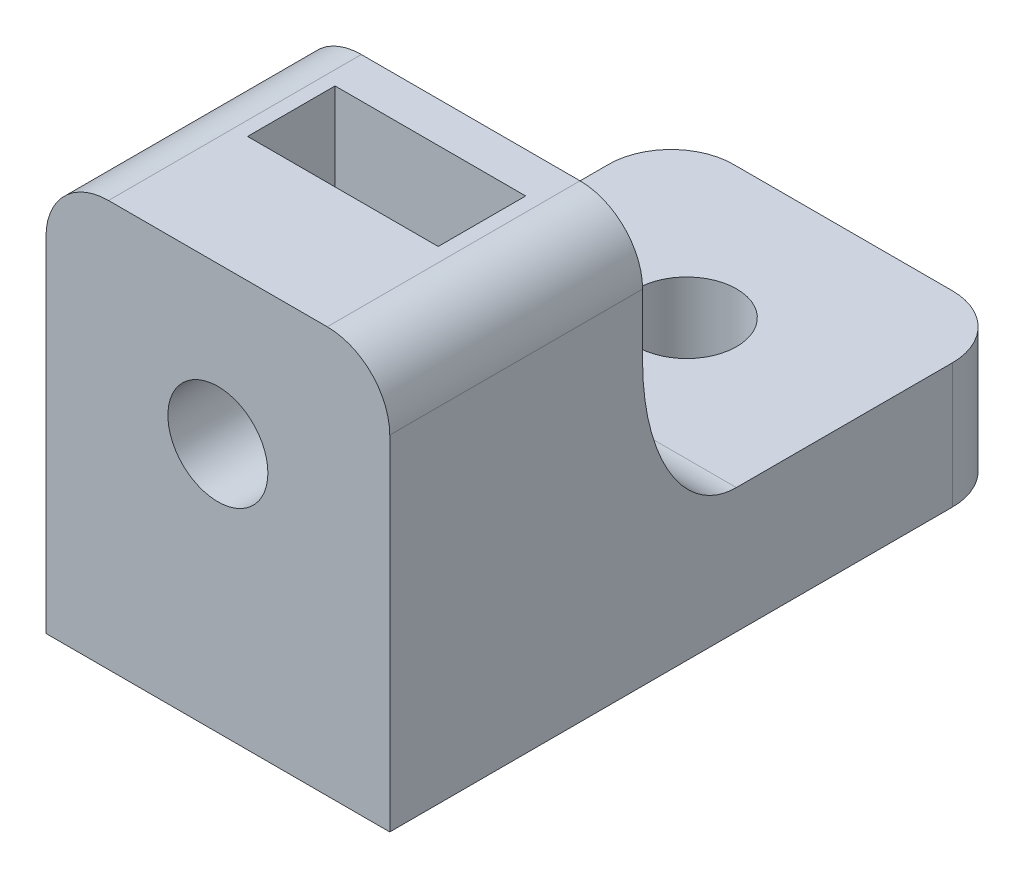
ISO-10303-21;
HEADER;
FILE_DESCRIPTION(('STEP AP214'),'2;1');
FILE_NAME('part.step','',(''),(''),'','','');
FILE_SCHEMA(('AUTOMOTIVE_DESIGN { 1 0 10303 214 1 1 1 1 }'));
ENDSEC;
DATA;
#1=APPLICATION_CONTEXT('core data for automotive mechanical design processes');
#2=APPLICATION_PROTOCOL_DEFINITION('international standard','automotive_design',2000,#1);
#3=PRODUCT_CONTEXT('',#1,'mechanical');
#4=PRODUCT('Part','Part','',(#3));
#5=PRODUCT_RELATED_PRODUCT_CATEGORY('part','',(#4));
#6=PRODUCT_DEFINITION_FORMATION('','',#4);
#7=PRODUCT_DEFINITION_CONTEXT('part definition',#1,'design');
#8=PRODUCT_DEFINITION('design','',#6,#7);
#9=PRODUCT_DEFINITION_SHAPE('','',#8);
#10=(LENGTH_UNIT() NAMED_UNIT(*) SI_UNIT(.MILLI.,.METRE.));
#11=(NAMED_UNIT(*) PLANE_ANGLE_UNIT() SI_UNIT($,.RADIAN.));
#12=(NAMED_UNIT(*) SI_UNIT($,.STERADIAN.) SOLID_ANGLE_UNIT());
#13=UNCERTAINTY_MEASURE_WITH_UNIT(LENGTH_MEASURE(1.E-05),#10,'distance_accuracy_value','');
#14=(GEOMETRIC_REPRESENTATION_CONTEXT(3) GLOBAL_UNCERTAINTY_ASSIGNED_CONTEXT((#13)) GLOBAL_UNIT_ASSIGNED_CONTEXT((#10,
#11,#12)) REPRESENTATION_CONTEXT('',''));
#15=CARTESIAN_POINT('',(0.,0.,0.));
#16=DIRECTION('',(0.,0.,1.));
#17=DIRECTION('',(1.,0.,0.));
#18=AXIS2_PLACEMENT_3D('',#15,#16,#17);
#19=CARTESIAN_POINT('',(0.,4.,0.));
#20=DIRECTION('',(0.,-1.,0.));
#21=DIRECTION('',(0.,0.,-1.));
#22=AXIS2_PLACEMENT_3D('',#19,#20,#21);
#23=PLANE('',#22);
#24=CARTESIAN_POINT('',(0.,4.,-15.));
#25=DIRECTION('',(0.,-1.,0.));
#26=DIRECTION('',(0.,0.,-1.));
#27=AXIS2_PLACEMENT_3D('',#24,#25,#26);
#28=CIRCLE('',#27,1.59999999999999);
#29=CARTESIAN_POINT('',(0.,4.,-16.6));
#30=VERTEX_POINT('',#29);
#31=EDGE_CURVE('E637',#30,#30,#28,.T.);
#32=ORIENTED_EDGE('',*,*,#31,.T.);
#33=EDGE_LOOP('',(#32));
#34=FACE_BOUND('',#33,.T.);
#35=DIRECTION('',(0.,0.,-1.));
#36=VECTOR('',#35,1.);
#37=CARTESIAN_POINT('',(5.5,4.,0.));
#38=LINE('',#37,#36);
#39=CARTESIAN_POINT('',(5.5,4.,-11.0899523705258));
#40=VERTEX_POINT('',#39);
#41=CARTESIAN_POINT('',(5.5,4.,-18.));
#42=VERTEX_POINT('',#41);
#43=EDGE_CURVE('E212',#40,#42,#38,.T.);
#44=ORIENTED_EDGE('',*,*,#43,.T.);
#45=CARTESIAN_POINT('',(3.5,4.,-18.));
#46=DIRECTION('',(0.,-1.,0.));
#47=DIRECTION('',(0.,0.,-1.));
#48=AXIS2_PLACEMENT_3D('',#45,#46,#47);
#49=CIRCLE('',#48,2.);
#50=CARTESIAN_POINT('',(3.5,4.,-20.));
#51=VERTEX_POINT('',#50);
#52=EDGE_CURVE('E13',#42,#51,#49,.F.);
#53=ORIENTED_EDGE('',*,*,#52,.T.);
#54=DIRECTION('',(1.,0.,0.));
#55=VECTOR('',#54,1.);
#56=CARTESIAN_POINT('',(-5.5,4.,-20.));
#57=LINE('',#56,#55);
#58=CARTESIAN_POINT('',(-3.5,4.,-20.));
#59=VERTEX_POINT('',#58);
#60=EDGE_CURVE('E204',#59,#51,#57,.T.);
#61=ORIENTED_EDGE('',*,*,#60,.F.);
#62=CARTESIAN_POINT('',(-3.5,4.,-18.));
#63=DIRECTION('',(0.,-1.,0.));
#64=DIRECTION('',(0.,0.,-1.));
#65=AXIS2_PLACEMENT_3D('',#62,#63,#64);
#66=CIRCLE('',#65,2.);
#67=CARTESIAN_POINT('',(-5.5,4.,-18.));
#68=VERTEX_POINT('',#67);
#69=EDGE_CURVE('E63',#59,#68,#66,.F.);
#70=ORIENTED_EDGE('',*,*,#69,.T.);
#71=DIRECTION('',(0.,0.,-1.));
#72=VECTOR('',#71,1.);
#73=CARTESIAN_POINT('',(-5.5,4.,0.));
#74=LINE('',#73,#72);
#75=CARTESIAN_POINT('',(-5.5,4.,-11.0899523705258));
#76=VERTEX_POINT('',#75);
#77=EDGE_CURVE('E207',#76,#68,#74,.T.);
#78=ORIENTED_EDGE('',*,*,#77,.F.);
#79=CARTESIAN_POINT('',(6.05,4.,-11.0899523705258));
#80=CARTESIAN_POINT('',(2.01666666666666,4.,-11.0899523705258));
#81=CARTESIAN_POINT('',(-2.01666666666666,4.,-11.0899523705258));
#82=CARTESIAN_POINT('',(-6.05,4.,-11.0899523705258));
#83=(BOUNDED_CURVE() B_SPLINE_CURVE(3,(#79,#80,#81,#82),.UNSPECIFIED.,.F.,
.F.) B_SPLINE_CURVE_WITH_KNOTS((4,4),(-0.00605,0.00605),
.UNSPECIFIED.) CURVE() GEOMETRIC_REPRESENTATION_ITEM() RATIONAL_B_SPLINE_CURVE((1.,1.,1.,1.)) REPRESENTATION_ITEM(''));
#84=EDGE_CURVE('E217',#76,#40,#83,.F.);
#85=ORIENTED_EDGE('',*,*,#84,.T.);
#86=EDGE_LOOP('',(#44,#53,#61,#70,#78,#85));
#87=FACE_BOUND('',#86,.T.);
#88=ADVANCED_FACE('F55',(#34,#87),#23,.F.);
#89=CARTESIAN_POINT('',(-5.5,4.,0.));
#90=DIRECTION('',(-1.,0.,0.));
#91=DIRECTION('',(0.,0.,1.));
#92=AXIS2_PLACEMENT_3D('',#89,#90,#91);
#93=PLANE('',#92);
#94=DIRECTION('',(0.,-1.,0.));
#95=VECTOR('',#94,1.);
#96=CARTESIAN_POINT('',(-5.5,4.,0.));
#97=LINE('',#96,#95);
#98=CARTESIAN_POINT('',(-5.5,11.,0.));
#99=VERTEX_POINT('',#98);
#100=CARTESIAN_POINT('',(-5.5,0.,0.));
#101=VERTEX_POINT('',#100);
#102=EDGE_CURVE('E601',#99,#101,#97,.T.);
#103=ORIENTED_EDGE('',*,*,#102,.F.);
#104=DIRECTION('',(0.,0.,-1.));
#105=VECTOR('',#104,1.);
#106=CARTESIAN_POINT('',(-5.5,11.,0.));
#107=LINE('',#106,#105);
#108=CARTESIAN_POINT('',(-5.5,11.,-8.08995237052581));
#109=VERTEX_POINT('',#108);
#110=EDGE_CURVE('E563',#99,#109,#107,.T.);
#111=ORIENTED_EDGE('',*,*,#110,.T.);
#112=DIRECTION('',(0.,-1.,0.));
#113=VECTOR('',#112,1.);
#114=CARTESIAN_POINT('',(-5.5,13.,-8.08995237052581));
#115=LINE('',#114,#113);
#116=CARTESIAN_POINT('',(-5.5,9.00000000000001,-8.08995237052581));
#117=VERTEX_POINT('',#116);
#118=EDGE_CURVE('E193',#109,#117,#115,.T.);
#119=ORIENTED_EDGE('',*,*,#118,.T.);
#120=CARTESIAN_POINT('',(-5.5,4.,-11.0899523705258));
#121=CARTESIAN_POINT('',(-5.5,4.,-8.08995237052581));
#122=CARTESIAN_POINT('',(-5.5,9.,-8.08995237052581));
#123=(BOUNDED_CURVE() B_SPLINE_CURVE(2,(#120,#121,#122),.UNSPECIFIED.,.F.,
.F.) B_SPLINE_CURVE_WITH_KNOTS((3,3),(0.,1.),
.UNSPECIFIED.) CURVE() GEOMETRIC_REPRESENTATION_ITEM() RATIONAL_B_SPLINE_CURVE((1.,
0.707106781186548,1.)) REPRESENTATION_ITEM(''));
#124=EDGE_CURVE('E267',#117,#76,#123,.F.);
#125=ORIENTED_EDGE('',*,*,#124,.T.);
#126=ORIENTED_EDGE('',*,*,#77,.T.);
#127=DIRECTION('',(0.,-1.,0.));
#128=VECTOR('',#127,1.);
#129=CARTESIAN_POINT('',(-5.5,4.,-18.));
#130=LINE('',#129,#128);
#131=CARTESIAN_POINT('',(-5.5,0.,-18.));
#132=VERTEX_POINT('',#131);
#133=EDGE_CURVE('E551',#68,#132,#130,.T.);
#134=ORIENTED_EDGE('',*,*,#133,.T.);
#135=DIRECTION('',(0.,0.,-1.));
#136=VECTOR('',#135,1.);
#137=CARTESIAN_POINT('',(-5.5,0.,0.));
#138=LINE('',#137,#136);
#139=EDGE_CURVE('E562',#101,#132,#138,.T.);
#140=ORIENTED_EDGE('',*,*,#139,.F.);
#141=EDGE_LOOP('',(#103,#111,#119,#125,#126,#134,#140));
#142=FACE_BOUND('',#141,.T.);
#143=ADVANCED_FACE('F233',(#142),#93,.T.);
#144=CARTESIAN_POINT('',(-5.5,4.,0.));
#145=DIRECTION('',(0.,0.,-1.));
#146=DIRECTION('',(-1.,0.,0.));
#147=AXIS2_PLACEMENT_3D('',#144,#145,#146);
#148=PLANE('',#147);
#149=CARTESIAN_POINT('',(0.,8.,0.));
#150=DIRECTION('',(0.,0.,1.));
#151=DIRECTION('',(1.,0.,0.));
#152=AXIS2_PLACEMENT_3D('',#149,#150,#151);
#153=CIRCLE('',#152,1.59999999999999);
#154=CARTESIAN_POINT('',(1.59999999999999,8.,0.));
#155=VERTEX_POINT('',#154);
#156=EDGE_CURVE('E653',#155,#155,#153,.T.);
#157=ORIENTED_EDGE('',*,*,#156,.F.);
#158=EDGE_LOOP('',(#157));
#159=FACE_BOUND('',#158,.T.);
#160=DIRECTION('',(1.,0.,0.));
#161=VECTOR('',#160,1.);
#162=CARTESIAN_POINT('',(0.,13.,0.));
#163=LINE('',#162,#161);
#164=CARTESIAN_POINT('',(-3.5,13.,0.));
#165=VERTEX_POINT('',#164);
#166=CARTESIAN_POINT('',(3.5,13.,0.));
#167=VERTEX_POINT('',#166);
#168=EDGE_CURVE('E628',#165,#167,#163,.T.);
#169=ORIENTED_EDGE('',*,*,#168,.F.);
#170=CARTESIAN_POINT('',(-3.5,11.,0.));
#171=DIRECTION('',(0.,0.,-1.));
#172=DIRECTION('',(-1.,0.,0.));
#173=AXIS2_PLACEMENT_3D('',#170,#171,#172);
#174=CIRCLE('',#173,2.);
#175=EDGE_CURVE('E575',#165,#99,#174,.F.);
#176=ORIENTED_EDGE('',*,*,#175,.T.);
#177=ORIENTED_EDGE('',*,*,#102,.T.);
#178=DIRECTION('',(1.,0.,0.));
#179=VECTOR('',#178,1.);
#180=CARTESIAN_POINT('',(-5.5,0.,0.));
#181=LINE('',#180,#179);
#182=CARTESIAN_POINT('',(5.5,0.,0.));
#183=VERTEX_POINT('',#182);
#184=EDGE_CURVE('E211',#101,#183,#181,.T.);
#185=ORIENTED_EDGE('',*,*,#184,.T.);
#186=DIRECTION('',(0.,-1.,0.));
#187=VECTOR('',#186,1.);
#188=CARTESIAN_POINT('',(5.5,4.,0.));
#189=LINE('',#188,#187);
#190=CARTESIAN_POINT('',(5.5,11.,0.));
#191=VERTEX_POINT('',#190);
#192=EDGE_CURVE('E602',#191,#183,#189,.T.);
#193=ORIENTED_EDGE('',*,*,#192,.F.);
#194=CARTESIAN_POINT('',(3.5,11.,0.));
#195=DIRECTION('',(0.,0.,-1.));
#196=DIRECTION('',(-1.,0.,0.));
#197=AXIS2_PLACEMENT_3D('',#194,#195,#196);
#198=CIRCLE('',#197,2.);
#199=EDGE_CURVE('E573',#191,#167,#198,.F.);
#200=ORIENTED_EDGE('',*,*,#199,.T.);
#201=EDGE_LOOP('',(#169,#176,#177,#185,#193,#200));
#202=FACE_BOUND('',#201,.T.);
#203=ADVANCED_FACE('F242',(#159,#202),#148,.F.);
#204=CARTESIAN_POINT('',(5.5,4.,0.));
#205=DIRECTION('',(-1.,0.,0.));
#206=DIRECTION('',(0.,0.,1.));
#207=AXIS2_PLACEMENT_3D('',#204,#205,#206);
#208=PLANE('',#207);
#209=DIRECTION('',(0.,-1.,0.));
#210=VECTOR('',#209,1.);
#211=CARTESIAN_POINT('',(5.5,13.,-8.08995237052581));
#212=LINE('',#211,#210);
#213=CARTESIAN_POINT('',(5.5,11.,-8.08995237052581));
#214=VERTEX_POINT('',#213);
#215=CARTESIAN_POINT('',(5.5,9.00000000000001,-8.08995237052581));
#216=VERTEX_POINT('',#215);
#217=EDGE_CURVE('E196',#214,#216,#212,.T.);
#218=ORIENTED_EDGE('',*,*,#217,.F.);
#219=DIRECTION('',(0.,0.,-1.));
#220=VECTOR('',#219,1.);
#221=CARTESIAN_POINT('',(5.5,11.,0.));
#222=LINE('',#221,#220);
#223=EDGE_CURVE('E579',#214,#191,#222,.F.);
#224=ORIENTED_EDGE('',*,*,#223,.T.);
#225=ORIENTED_EDGE('',*,*,#192,.T.);
#226=DIRECTION('',(0.,0.,-1.));
#227=VECTOR('',#226,1.);
#228=CARTESIAN_POINT('',(5.5,0.,0.));
#229=LINE('',#228,#227);
#230=CARTESIAN_POINT('',(5.5,0.,-18.));
#231=VERTEX_POINT('',#230);
#232=EDGE_CURVE('E609',#183,#231,#229,.T.);
#233=ORIENTED_EDGE('',*,*,#232,.T.);
#234=DIRECTION('',(0.,-1.,0.));
#235=VECTOR('',#234,1.);
#236=CARTESIAN_POINT('',(5.5,4.,-18.));
#237=LINE('',#236,#235);
#238=EDGE_CURVE('E577',#231,#42,#237,.F.);
#239=ORIENTED_EDGE('',*,*,#238,.T.);
#240=ORIENTED_EDGE('',*,*,#43,.F.);
#241=CARTESIAN_POINT('',(5.5,9.,-8.08995237052581));
#242=CARTESIAN_POINT('',(5.5,4.,-8.08995237052581));
#243=CARTESIAN_POINT('',(5.5,4.,-11.0899523705258));
#244=(BOUNDED_CURVE() B_SPLINE_CURVE(2,(#241,#242,#243),.UNSPECIFIED.,.F.,
.F.) B_SPLINE_CURVE_WITH_KNOTS((3,3),(0.,1.),
.UNSPECIFIED.) CURVE() GEOMETRIC_REPRESENTATION_ITEM() RATIONAL_B_SPLINE_CURVE((1.,
0.707106781186548,1.)) REPRESENTATION_ITEM(''));
#245=EDGE_CURVE('E597',#40,#216,#244,.F.);
#246=ORIENTED_EDGE('',*,*,#245,.T.);
#247=EDGE_LOOP('',(#218,#224,#225,#233,#239,#240,#246));
#248=FACE_BOUND('',#247,.T.);
#249=ADVANCED_FACE('F245',(#248),#208,.F.);
#250=CARTESIAN_POINT('',(-5.5,4.,-20.));
#251=DIRECTION('',(0.,0.,-1.));
#252=DIRECTION('',(-1.,0.,0.));
#253=AXIS2_PLACEMENT_3D('',#250,#251,#252);
#254=PLANE('',#253);
#255=ORIENTED_EDGE('',*,*,#60,.T.);
#256=DIRECTION('',(0.,-1.,0.));
#257=VECTOR('',#256,1.);
#258=CARTESIAN_POINT('',(3.5,0.,-20.));
#259=LINE('',#258,#257);
#260=CARTESIAN_POINT('',(3.5,0.,-20.));
#261=VERTEX_POINT('',#260);
#262=EDGE_CURVE('E582',#51,#261,#259,.T.);
#263=ORIENTED_EDGE('',*,*,#262,.T.);
#264=DIRECTION('',(1.,0.,0.));
#265=VECTOR('',#264,1.);
#266=CARTESIAN_POINT('',(-5.5,0.,-20.));
#267=LINE('',#266,#265);
#268=CARTESIAN_POINT('',(-3.5,0.,-20.));
#269=VERTEX_POINT('',#268);
#270=EDGE_CURVE('E612',#269,#261,#267,.T.);
#271=ORIENTED_EDGE('',*,*,#270,.F.);
#272=DIRECTION('',(0.,-1.,0.));
#273=VECTOR('',#272,1.);
#274=CARTESIAN_POINT('',(-3.5,4.,-20.));
#275=LINE('',#274,#273);
#276=EDGE_CURVE('E75',#269,#59,#275,.F.);
#277=ORIENTED_EDGE('',*,*,#276,.T.);
#278=EDGE_LOOP('',(#255,#263,#271,#277));
#279=FACE_BOUND('',#278,.T.);
#280=ADVANCED_FACE('F240',(#279),#254,.T.);
#281=CARTESIAN_POINT('',(0.,0.,0.));
#282=DIRECTION('',(0.,-1.,0.));
#283=DIRECTION('',(0.,0.,-1.));
#284=AXIS2_PLACEMENT_3D('',#281,#282,#283);
#285=PLANE('',#284);
#286=CARTESIAN_POINT('',(0.,0.,-15.));
#287=DIRECTION('',(0.,-1.,0.));
#288=DIRECTION('',(0.,0.,-1.));
#289=AXIS2_PLACEMENT_3D('',#286,#287,#288);
#290=CIRCLE('',#289,1.59999999999999);
#291=CARTESIAN_POINT('',(0.,0.,-16.6));
#292=VERTEX_POINT('',#291);
#293=EDGE_CURVE('E640',#292,#292,#290,.T.);
#294=ORIENTED_EDGE('',*,*,#293,.F.);
#295=EDGE_LOOP('',(#294));
#296=FACE_BOUND('',#295,.T.);
#297=ORIENTED_EDGE('',*,*,#270,.T.);
#298=CARTESIAN_POINT('',(3.5,0.,-18.));
#299=DIRECTION('',(0.,-1.,0.));
#300=DIRECTION('',(0.,0.,-1.));
#301=AXIS2_PLACEMENT_3D('',#298,#299,#300);
#302=CIRCLE('',#301,2.);
#303=EDGE_CURVE('E587',#261,#231,#302,.T.);
#304=ORIENTED_EDGE('',*,*,#303,.T.);
#305=ORIENTED_EDGE('',*,*,#232,.F.);
#306=ORIENTED_EDGE('',*,*,#184,.F.);
#307=ORIENTED_EDGE('',*,*,#139,.T.);
#308=CARTESIAN_POINT('',(-3.5,0.,-18.));
#309=DIRECTION('',(0.,-1.,0.));
#310=DIRECTION('',(0.,0.,-1.));
#311=AXIS2_PLACEMENT_3D('',#308,#309,#310);
#312=CIRCLE('',#311,2.);
#313=EDGE_CURVE('E585',#132,#269,#312,.T.);
#314=ORIENTED_EDGE('',*,*,#313,.T.);
#315=EDGE_LOOP('',(#297,#304,#305,#306,#307,#314));
#316=FACE_BOUND('',#315,.T.);
#317=ADVANCED_FACE('F236',(#296,#316),#285,.T.);
#318=CARTESIAN_POINT('',(0.,13.,-8.08995237052581));
#319=DIRECTION('',(0.,0.,1.));
#320=DIRECTION('',(1.,0.,0.));
#321=AXIS2_PLACEMENT_3D('',#318,#319,#320);
#322=PLANE('',#321);
#323=ORIENTED_EDGE('',*,*,#118,.F.);
#324=CARTESIAN_POINT('',(-3.5,11.,-8.08995237052581));
#325=DIRECTION('',(0.,0.,1.));
#326=DIRECTION('',(1.,0.,0.));
#327=AXIS2_PLACEMENT_3D('',#324,#325,#326);
#328=CIRCLE('',#327,2.);
#329=CARTESIAN_POINT('',(-3.5,13.,-8.08995237052581));
#330=VERTEX_POINT('',#329);
#331=EDGE_CURVE('E566',#109,#330,#328,.F.);
#332=ORIENTED_EDGE('',*,*,#331,.T.);
#333=DIRECTION('',(-1.,0.,0.));
#334=VECTOR('',#333,1.);
#335=CARTESIAN_POINT('',(0.,13.,-8.08995237052581));
#336=LINE('',#335,#334);
#337=CARTESIAN_POINT('',(3.5,13.,-8.08995237052581));
#338=VERTEX_POINT('',#337);
#339=EDGE_CURVE('E556',#338,#330,#336,.T.);
#340=ORIENTED_EDGE('',*,*,#339,.F.);
#341=CARTESIAN_POINT('',(3.5,11.,-8.08995237052581));
#342=DIRECTION('',(0.,0.,1.));
#343=DIRECTION('',(1.,0.,0.));
#344=AXIS2_PLACEMENT_3D('',#341,#342,#343);
#345=CIRCLE('',#344,2.);
#346=EDGE_CURVE('E564',#338,#214,#345,.F.);
#347=ORIENTED_EDGE('',*,*,#346,.T.);
#348=ORIENTED_EDGE('',*,*,#217,.T.);
#349=CARTESIAN_POINT('',(-6.05,9.,-8.08995237052581));
#350=CARTESIAN_POINT('',(-2.01666666666666,9.,-8.08995237052581));
#351=CARTESIAN_POINT('',(2.01666666666666,9.,-8.08995237052581));
#352=CARTESIAN_POINT('',(6.05,9.,-8.08995237052581));
#353=(BOUNDED_CURVE() B_SPLINE_CURVE(3,(#349,#350,#351,#352),.UNSPECIFIED.,.F.,
.F.) B_SPLINE_CURVE_WITH_KNOTS((4,4),(-0.00605,0.00605),
.UNSPECIFIED.) CURVE() GEOMETRIC_REPRESENTATION_ITEM() RATIONAL_B_SPLINE_CURVE((1.,1.,1.,1.)) REPRESENTATION_ITEM(''));
#354=CARTESIAN_POINT('',(1.24899959967967,9.,-8.08995237052581));
#355=VERTEX_POINT('',#354);
#356=EDGE_CURVE('E600',#216,#355,#353,.F.);
#357=ORIENTED_EDGE('',*,*,#356,.T.);
#358=CARTESIAN_POINT('',(0.,8.,-8.08995237052581));
#359=DIRECTION('',(0.,0.,1.));
#360=DIRECTION('',(1.,0.,0.));
#361=AXIS2_PLACEMENT_3D('',#358,#359,#360);
#362=CIRCLE('',#361,1.59999999999999);
#363=CARTESIAN_POINT('',(-1.24899959967967,9.,-8.08995237052581));
#364=VERTEX_POINT('',#363);
#365=EDGE_CURVE('E649',#355,#364,#362,.T.);
#366=ORIENTED_EDGE('',*,*,#365,.T.);
#367=CARTESIAN_POINT('',(-6.05,9.,-8.08995237052581));
#368=CARTESIAN_POINT('',(-2.01666666666666,9.,-8.08995237052581));
#369=CARTESIAN_POINT('',(2.01666666666666,9.,-8.08995237052581));
#370=CARTESIAN_POINT('',(6.05,9.,-8.08995237052581));
#371=(BOUNDED_CURVE() B_SPLINE_CURVE(3,(#367,#368,#369,#370),.UNSPECIFIED.,.F.,
.F.) B_SPLINE_CURVE_WITH_KNOTS((4,4),(-0.00605,0.00605),
.UNSPECIFIED.) CURVE() GEOMETRIC_REPRESENTATION_ITEM() RATIONAL_B_SPLINE_CURVE((1.,1.,1.,1.)) REPRESENTATION_ITEM(''));
#372=EDGE_CURVE('E382',#364,#117,#371,.F.);
#373=ORIENTED_EDGE('',*,*,#372,.T.);
#374=EDGE_LOOP('',(#323,#332,#340,#347,#348,#357,#366,#373));
#375=FACE_BOUND('',#374,.T.);
#376=ADVANCED_FACE('F239',(#375),#322,.F.);
#377=CARTESIAN_POINT('',(-3.05,13.,0.));
#378=DIRECTION('',(1.,0.,0.));
#379=DIRECTION('',(0.,0.,-1.));
#380=AXIS2_PLACEMENT_3D('',#377,#378,#379);
#381=PLANE('',#380);
#382=DIRECTION('',(0.,0.,1.));
#383=VECTOR('',#382,1.);
#384=CARTESIAN_POINT('',(-3.05,4.8,0.));
#385=LINE('',#384,#383);
#386=CARTESIAN_POINT('',(-3.05,4.8,-6.8));
#387=VERTEX_POINT('',#386);
#388=CARTESIAN_POINT('',(-3.05,4.8,-4.));
#389=VERTEX_POINT('',#388);
#390=EDGE_CURVE('E170',#387,#389,#385,.T.);
#391=ORIENTED_EDGE('',*,*,#390,.F.);
#392=DIRECTION('',(0.,-1.,0.));
#393=VECTOR('',#392,1.);
#394=CARTESIAN_POINT('',(-3.05,13.,-6.8));
#395=LINE('',#394,#393);
#396=CARTESIAN_POINT('',(-3.05,13.,-6.8));
#397=VERTEX_POINT('',#396);
#398=EDGE_CURVE('E182',#397,#387,#395,.T.);
#399=ORIENTED_EDGE('',*,*,#398,.F.);
#400=DIRECTION('',(0.,0.,1.));
#401=VECTOR('',#400,1.);
#402=CARTESIAN_POINT('',(-3.05,13.,0.));
#403=LINE('',#402,#401);
#404=CARTESIAN_POINT('',(-3.05,13.,-4.));
#405=VERTEX_POINT('',#404);
#406=EDGE_CURVE('E635',#397,#405,#403,.T.);
#407=ORIENTED_EDGE('',*,*,#406,.T.);
#408=DIRECTION('',(0.,-1.,0.));
#409=VECTOR('',#408,1.);
#410=CARTESIAN_POINT('',(-3.05,13.,-4.));
#411=LINE('',#410,#409);
#412=EDGE_CURVE('E185',#405,#389,#411,.T.);
#413=ORIENTED_EDGE('',*,*,#412,.T.);
#414=EDGE_LOOP('',(#391,#399,#407,#413));
#415=FACE_BOUND('',#414,.T.);
#416=ADVANCED_FACE('F180',(#415),#381,.T.);
#417=CARTESIAN_POINT('',(0.,13.,-6.8));
#418=DIRECTION('',(0.,0.,1.));
#419=DIRECTION('',(1.,0.,0.));
#420=AXIS2_PLACEMENT_3D('',#417,#418,#419);
#421=PLANE('',#420);
#422=DIRECTION('',(-1.,0.,0.));
#423=VECTOR('',#422,1.);
#424=CARTESIAN_POINT('',(0.,4.8,-6.8));
#425=LINE('',#424,#423);
#426=CARTESIAN_POINT('',(3.05,4.8,-6.8));
#427=VERTEX_POINT('',#426);
#428=EDGE_CURVE('E167',#427,#387,#425,.T.);
#429=ORIENTED_EDGE('',*,*,#428,.F.);
#430=DIRECTION('',(0.,-1.,0.));
#431=VECTOR('',#430,1.);
#432=CARTESIAN_POINT('',(3.05,13.,-6.8));
#433=LINE('',#432,#431);
#434=CARTESIAN_POINT('',(3.05,13.,-6.8));
#435=VERTEX_POINT('',#434);
#436=EDGE_CURVE('E194',#435,#427,#433,.T.);
#437=ORIENTED_EDGE('',*,*,#436,.F.);
#438=DIRECTION('',(-1.,0.,0.));
#439=VECTOR('',#438,1.);
#440=CARTESIAN_POINT('',(0.,13.,-6.8));
#441=LINE('',#440,#439);
#442=EDGE_CURVE('E192',#435,#397,#441,.T.);
#443=ORIENTED_EDGE('',*,*,#442,.T.);
#444=ORIENTED_EDGE('',*,*,#398,.T.);
#445=EDGE_LOOP('',(#429,#437,#443,#444));
#446=FACE_BOUND('',#445,.T.);
#447=CARTESIAN_POINT('',(0.,8.,-6.8));
#448=DIRECTION('',(0.,0.,1.));
#449=DIRECTION('',(1.,0.,0.));
#450=AXIS2_PLACEMENT_3D('',#447,#448,#449);
#451=CIRCLE('',#450,1.59999999999999);
#452=CARTESIAN_POINT('',(1.59999999999999,8.,-6.8));
#453=VERTEX_POINT('',#452);
#454=EDGE_CURVE('E643',#453,#453,#451,.T.);
#455=ORIENTED_EDGE('',*,*,#454,.F.);
#456=EDGE_LOOP('',(#455));
#457=FACE_BOUND('',#456,.T.);
#458=ADVANCED_FACE('F189',(#446,#457),#421,.T.);
#459=CARTESIAN_POINT('',(3.05,13.,0.));
#460=DIRECTION('',(1.,0.,0.));
#461=DIRECTION('',(0.,0.,-1.));
#462=AXIS2_PLACEMENT_3D('',#459,#460,#461);
#463=PLANE('',#462);
#464=ORIENTED_EDGE('',*,*,#436,.T.);
#465=DIRECTION('',(0.,0.,1.));
#466=VECTOR('',#465,1.);
#467=CARTESIAN_POINT('',(3.05,4.8,0.));
#468=LINE('',#467,#466);
#469=CARTESIAN_POINT('',(3.05,4.8,-4.));
#470=VERTEX_POINT('',#469);
#471=EDGE_CURVE('E173',#427,#470,#468,.T.);
#472=ORIENTED_EDGE('',*,*,#471,.T.);
#473=DIRECTION('',(0.,-1.,0.));
#474=VECTOR('',#473,1.);
#475=CARTESIAN_POINT('',(3.05,13.,-4.));
#476=LINE('',#475,#474);
#477=CARTESIAN_POINT('',(3.05,13.,-4.));
#478=VERTEX_POINT('',#477);
#479=EDGE_CURVE('E198',#478,#470,#476,.T.);
#480=ORIENTED_EDGE('',*,*,#479,.F.);
#481=DIRECTION('',(0.,0.,1.));
#482=VECTOR('',#481,1.);
#483=CARTESIAN_POINT('',(3.05,13.,0.));
#484=LINE('',#483,#482);
#485=EDGE_CURVE('E630',#435,#478,#484,.T.);
#486=ORIENTED_EDGE('',*,*,#485,.F.);
#487=EDGE_LOOP('',(#464,#472,#480,#486));
#488=FACE_BOUND('',#487,.T.);
#489=ADVANCED_FACE('F404',(#488),#463,.F.);
#490=CARTESIAN_POINT('',(0.,13.,-4.));
#491=DIRECTION('',(0.,0.,1.));
#492=DIRECTION('',(1.,0.,0.));
#493=AXIS2_PLACEMENT_3D('',#490,#491,#492);
#494=PLANE('',#493);
#495=CARTESIAN_POINT('',(0.,8.,-4.));
#496=DIRECTION('',(0.,0.,1.));
#497=DIRECTION('',(1.,0.,0.));
#498=AXIS2_PLACEMENT_3D('',#495,#496,#497);
#499=CIRCLE('',#498,1.59999999999999);
#500=CARTESIAN_POINT('',(1.59999999999999,8.,-4.));
#501=VERTEX_POINT('',#500);
#502=EDGE_CURVE('E646',#501,#501,#499,.T.);
#503=ORIENTED_EDGE('',*,*,#502,.T.);
#504=EDGE_LOOP('',(#503));
#505=FACE_BOUND('',#504,.T.);
#506=ORIENTED_EDGE('',*,*,#479,.T.);
#507=DIRECTION('',(-1.,0.,0.));
#508=VECTOR('',#507,1.);
#509=CARTESIAN_POINT('',(0.,4.8,-4.));
#510=LINE('',#509,#508);
#511=EDGE_CURVE('E186',#470,#389,#510,.T.);
#512=ORIENTED_EDGE('',*,*,#511,.T.);
#513=ORIENTED_EDGE('',*,*,#412,.F.);
#514=DIRECTION('',(-1.,0.,0.));
#515=VECTOR('',#514,1.);
#516=CARTESIAN_POINT('',(0.,13.,-4.));
#517=LINE('',#516,#515);
#518=EDGE_CURVE('E629',#478,#405,#517,.T.);
#519=ORIENTED_EDGE('',*,*,#518,.F.);
#520=EDGE_LOOP('',(#506,#512,#513,#519));
#521=FACE_BOUND('',#520,.T.);
#522=ADVANCED_FACE('F401',(#505,#521),#494,.F.);
#523=CARTESIAN_POINT('',(0.,13.,0.));
#524=DIRECTION('',(0.,1.,0.));
#525=DIRECTION('',(0.,0.,1.));
#526=AXIS2_PLACEMENT_3D('',#523,#524,#525);
#527=PLANE('',#526);
#528=ORIENTED_EDGE('',*,*,#406,.F.);
#529=ORIENTED_EDGE('',*,*,#442,.F.);
#530=ORIENTED_EDGE('',*,*,#485,.T.);
#531=ORIENTED_EDGE('',*,*,#518,.T.);
#532=EDGE_LOOP('',(#528,#529,#530,#531));
#533=FACE_BOUND('',#532,.T.);
#534=ORIENTED_EDGE('',*,*,#339,.T.);
#535=DIRECTION('',(0.,0.,-1.));
#536=VECTOR('',#535,1.);
#537=CARTESIAN_POINT('',(-3.5,13.,0.));
#538=LINE('',#537,#536);
#539=EDGE_CURVE('E571',#330,#165,#538,.F.);
#540=ORIENTED_EDGE('',*,*,#539,.T.);
#541=ORIENTED_EDGE('',*,*,#168,.T.);
#542=DIRECTION('',(0.,0.,-1.));
#543=VECTOR('',#542,1.);
#544=CARTESIAN_POINT('',(3.5,13.,-8.08995237052581));
#545=LINE('',#544,#543);
#546=EDGE_CURVE('E568',#167,#338,#545,.T.);
#547=ORIENTED_EDGE('',*,*,#546,.T.);
#548=EDGE_LOOP('',(#534,#540,#541,#547));
#549=FACE_BOUND('',#548,.T.);
#550=ADVANCED_FACE('F289',(#533,#549),#527,.T.);
#551=CARTESIAN_POINT('',(-6.05,4.,-11.0899523705258));
#552=CARTESIAN_POINT('',(-2.01666666666666,4.,-11.0899523705258));
#553=CARTESIAN_POINT('',(2.01666666666666,4.,-11.0899523705258));
#554=CARTESIAN_POINT('',(6.05,4.,-11.0899523705258));
#555=CARTESIAN_POINT('',(-6.05,4.,-8.08995237052581));
#556=CARTESIAN_POINT('',(-2.01666666666666,4.,-8.08995237052581));
#557=CARTESIAN_POINT('',(2.01666666666666,4.,-8.08995237052581));
#558=CARTESIAN_POINT('',(6.05,4.,-8.08995237052581));
#559=CARTESIAN_POINT('',(-6.05,9.,-8.08995237052581));
#560=CARTESIAN_POINT('',(-2.01666666666666,9.,-8.08995237052581));
#561=CARTESIAN_POINT('',(2.01666666666666,9.,-8.08995237052581));
#562=CARTESIAN_POINT('',(6.05,9.,-8.08995237052581));
#563=(BOUNDED_SURFACE() B_SPLINE_SURFACE(2,3,((#551,#552,#553,#554),(#555,#556,#557,#558),(#559,
#560,#561,#562)),.UNSPECIFIED.,.F.,.F.,.F.) B_SPLINE_SURFACE_WITH_KNOTS((3,3),(4,4),(0.,1.),
(-0.00605,0.00605),
.UNSPECIFIED.) GEOMETRIC_REPRESENTATION_ITEM() RATIONAL_B_SPLINE_SURFACE(((1.,1.,1.,1.),
(0.707106781186548,0.707106781186548,0.707106781186548,0.707106781186548),(1.,1.,1.,1.))) REPRESENTATION_ITEM('') SURFACE());
#564=CARTESIAN_POINT('',(-1.24899959967967,9.,-8.08995237052581));
#565=CARTESIAN_POINT('',(-1.27678745435603,8.96529392214953,-8.08995185790162));
#566=CARTESIAN_POINT('',(-1.30311519559637,8.92944309660353,-8.09016943443913));
#567=CARTESIAN_POINT('',(-1.35269414639994,8.85568343640425,-8.09112058469751));
#568=CARTESIAN_POINT('',(-1.37594553293495,8.81777472031119,-8.09185412872126));
#569=CARTESIAN_POINT('',(-1.44078211553794,8.70143401652357,-8.09494496893268));
#570=CARTESIAN_POINT('',(-1.4775447341588,8.62026854448331,-8.09819193504342));
#571=CARTESIAN_POINT('',(-1.53708393495765,8.45305060225022,-8.10753047452717));
#572=CARTESIAN_POINT('',(-1.55985095908922,8.36699483603603,-8.11362398691199));
#573=CARTESIAN_POINT('',(-1.58307744398425,8.23628488873141,-8.12503597626146));
#574=CARTESIAN_POINT('',(-1.58899897121057,8.19243987328803,-8.12921906730405));
#575=CARTESIAN_POINT('',(-1.59719883447628,8.10444991136329,-8.13834353085014));
#576=CARTESIAN_POINT('',(-1.59947400621649,8.06030473772592,-8.14328555788622));
#577=CARTESIAN_POINT('',(-1.60080507346764,7.92807745658,-8.15921037819308));
#578=CARTESIAN_POINT('',(-1.59439915573903,7.84001784226452,-8.17130798612193));
#579=CARTESIAN_POINT('',(-1.56732517576211,7.66652572210334,-8.19810942570079));
#580=CARTESIAN_POINT('',(-1.54665426088752,7.58109374528641,-8.21281377819439));
#581=CARTESIAN_POINT('',(-1.50527393873932,7.45580988685844,-8.2364832675125));
#582=CARTESIAN_POINT('',(-1.48953784751521,7.41411976233665,-8.24473379171677));
#583=CARTESIAN_POINT('',(-1.45470100435284,7.33230232438847,-8.26162504968136));
#584=CARTESIAN_POINT('',(-1.43560352610307,7.29217353637355,-8.27026539775436));
#585=CARTESIAN_POINT('',(-1.37342250301528,7.17442113503033,-8.29661523632765));
#586=CARTESIAN_POINT('',(-1.32544356656735,7.09941100545134,-8.31475745345594));
#587=CARTESIAN_POINT('',(-1.21624573420533,6.95641250192023,-8.35155935652578));
#588=CARTESIAN_POINT('',(-1.1546928475845,6.88868048955303,-8.37021926603706));
#589=CARTESIAN_POINT('',(-1.0207207561937,6.76449705200673,-8.40618212757983));
#590=CARTESIAN_POINT('',(-0.948300302102102,6.70804692552081,-8.42348492325059));
#591=CARTESIAN_POINT('',(-0.794439579127565,6.60813905202878,-8.45526154522642));
#592=CARTESIAN_POINT('',(-0.713001467287789,6.56467820711986,-8.46973604578541));
#593=CARTESIAN_POINT('',(-0.543320282836552,6.49225270308517,-8.49444396465543));
#594=CARTESIAN_POINT('',(-0.455080015078053,6.46328210545255,-8.50467912007204));
#595=CARTESIAN_POINT('',(-0.278693668235909,6.42197957932137,-8.51943247783806));
#596=CARTESIAN_POINT('',(-0.190735138588552,6.40893465256647,-8.52419505109156));
#597=CARTESIAN_POINT('',(-0.0137571796177215,6.39760595441588,-8.52832511001243));
#598=CARTESIAN_POINT('',(0.075261937398664,6.39931793989314,-8.52769414651019));
#599=CARTESIAN_POINT('',(0.247761143133976,6.41702531576241,-8.52125616059238));
#600=CARTESIAN_POINT('',(0.331314446994428,6.432400871917,-8.51567377508439));
#601=CARTESIAN_POINT('',(0.494568679524117,6.47601101487964,-8.50019543411705));
#602=CARTESIAN_POINT('',(0.574269210945333,6.50424692456604,-8.49029903490182));
#603=CARTESIAN_POINT('',(0.729155964999907,6.57323960134497,-8.46688706236474));
#604=CARTESIAN_POINT('',(0.804239751212586,6.61420529825975,-8.45331162074747));
#605=CARTESIAN_POINT('',(0.946625403668783,6.70727436175487,-8.42375227101167));
#606=CARTESIAN_POINT('',(1.01392524032111,6.75938062308888,-8.40776773723609));
#607=CARTESIAN_POINT('',(1.14265603643419,6.87647517524752,-8.37366202043299));
#608=CARTESIAN_POINT('',(1.2035757813996,6.94200607435998,-8.3554721305882));
#609=CARTESIAN_POINT('',(1.31367105586754,7.08227421850149,-8.31900664953575));
#610=CARTESIAN_POINT('',(1.36284445423125,7.15701313041695,-8.30073104338894));
#611=CARTESIAN_POINT('',(1.44936936798221,7.31607505938627,-8.26473486820372));
#612=CARTESIAN_POINT('',(1.4863447986028,7.40061023254454,-8.24704487696053));
#613=CARTESIAN_POINT('',(1.54531252955814,7.57515647119754,-8.21381757804712));
#614=CARTESIAN_POINT('',(1.56730642609504,7.66516695221407,-8.19828004118499));
#615=CARTESIAN_POINT('',(1.59523353302095,7.8466290244447,-8.17032678406154));
#616=CARTESIAN_POINT('',(1.60141594929474,7.93803511404936,-8.15786545740154));
#617=CARTESIAN_POINT('',(1.59804026823353,8.12095566573545,-8.13614988997909));
#618=CARTESIAN_POINT('',(1.58848213858241,8.212470128039,-8.12689565580101));
#619=CARTESIAN_POINT('',(1.55424374080266,8.39025707226458,-8.11186876082617));
#620=CARTESIAN_POINT('',(1.5299888567934,8.47660452949392,-8.10600691916228));
#621=CARTESIAN_POINT('',(1.46734064424124,8.64411662180398,-8.09713676413209));
#622=CARTESIAN_POINT('',(1.42896240551326,8.72528668036526,-8.09412541743358));
#623=CARTESIAN_POINT('',(1.36408512634294,8.8371829802171,-8.09147086495662));
#624=CARTESIAN_POINT('',(1.34275680825129,8.87097760365925,-8.0908859698978));
#625=CARTESIAN_POINT('',(1.29767391461833,8.9368181853319,-8.09012714682948));
#626=CARTESIAN_POINT('',(1.27392404084519,8.96886735364409,-8.08995243766783));
#627=CARTESIAN_POINT('',(1.2489995996797,9.,-8.08995237052581));
#628=B_SPLINE_CURVE_WITH_KNOTS('',3,(#564,#565,#566,#567,#568,#569,#570,#571,#572,#573,#574,
#575,#576,#577,#578,#579,#580,#581,#582,#583,#584,#585,#586,#587,#588,#589,#590,#591,#592,#593,
#594,#595,#596,#597,#598,#599,#600,#601,#602,#603,#604,#605,#606,#607,#608,#609,#610,#611,#612,
#613,#614,#615,#616,#617,#618,#619,#620,#621,#622,#623,#624,#625,#626,#627),.UNSPECIFIED.,.F.,
.F.,(4,2,2,2,2,2,2,2,2,2,2,2,2,2,2,2,2,2,2,2,2,2,2,2,2,2,2,2,2,2,2,4),(0.,0.133302221917791,
0.266596772094271,0.532735079472842,0.799054940017712,0.932238631250277,1.06553783653509,
1.3315756601617,1.59766669981595,1.73348634766429,1.86917444401257,2.14048562686085,
2.41941634391241,2.69837915108078,2.97727537330776,3.25605720225004,3.52183684337653,
3.7875400661346,4.04177234484948,4.29603078103814,4.55470484417814,4.81344620280405,
5.08612113624272,5.35884550356459,5.63932796738252,5.91978054262119,6.19578485271095,
6.47178972945206,6.74016396043179,7.00825228092091,7.12805699606679,7.24763337110921),.UNSPECIFIED.);
#629=EDGE_CURVE('E548',#364,#355,#628,.T.);
#630=ORIENTED_EDGE('',*,*,#372,.F.);
#631=ORIENTED_EDGE('',*,*,#629,.T.);
#632=ORIENTED_EDGE('',*,*,#356,.F.);
#633=ORIENTED_EDGE('',*,*,#245,.F.);
#634=ORIENTED_EDGE('',*,*,#84,.F.);
#635=ORIENTED_EDGE('',*,*,#124,.F.);
#636=EDGE_LOOP('',(#630,#631,#632,#633,#634,#635));
#637=FACE_BOUND('',#636,.T.);
#638=ADVANCED_FACE('F275',(#637),#563,.T.);
#639=CARTESIAN_POINT('',(0.,0.,-15.));
#640=DIRECTION('',(0.,-1.,0.));
#641=DIRECTION('',(0.,0.,-1.));
#642=AXIS2_PLACEMENT_3D('',#639,#640,#641);
#643=CYLINDRICAL_SURFACE('',#642,1.59999999999999);
#644=ORIENTED_EDGE('',*,*,#293,.T.);
#645=EDGE_LOOP('',(#644));
#646=FACE_BOUND('',#645,.T.);
#647=ORIENTED_EDGE('',*,*,#31,.F.);
#648=EDGE_LOOP('',(#647));
#649=FACE_BOUND('',#648,.T.);
#650=ADVANCED_FACE('F288',(#646,#649),#643,.F.);
#651=CARTESIAN_POINT('',(0.,8.,0.));
#652=DIRECTION('',(0.,0.,1.));
#653=DIRECTION('',(1.,0.,0.));
#654=AXIS2_PLACEMENT_3D('',#651,#652,#653);
#655=CYLINDRICAL_SURFACE('',#654,1.59999999999999);
#656=ORIENTED_EDGE('',*,*,#454,.T.);
#657=EDGE_LOOP('',(#656));
#658=FACE_BOUND('',#657,.T.);
#659=ORIENTED_EDGE('',*,*,#629,.F.);
#660=ORIENTED_EDGE('',*,*,#365,.F.);
#661=EDGE_LOOP('',(#659,#660));
#662=FACE_BOUND('',#661,.T.);
#663=ADVANCED_FACE('F518',(#658,#662),#655,.F.);
#664=ORIENTED_EDGE('',*,*,#156,.T.);
#665=EDGE_LOOP('',(#664));
#666=FACE_BOUND('',#665,.T.);
#667=ORIENTED_EDGE('',*,*,#502,.F.);
#668=EDGE_LOOP('',(#667));
#669=FACE_BOUND('',#668,.T.);
#670=ADVANCED_FACE('F456',(#666,#669),#655,.F.);
#671=CARTESIAN_POINT('',(0.,4.8,0.));
#672=DIRECTION('',(0.,1.,0.));
#673=DIRECTION('',(0.,0.,1.));
#674=AXIS2_PLACEMENT_3D('',#671,#672,#673);
#675=PLANE('',#674);
#676=ORIENTED_EDGE('',*,*,#428,.T.);
#677=ORIENTED_EDGE('',*,*,#390,.T.);
#678=ORIENTED_EDGE('',*,*,#511,.F.);
#679=ORIENTED_EDGE('',*,*,#471,.F.);
#680=EDGE_LOOP('',(#676,#677,#678,#679));
#681=FACE_BOUND('',#680,.T.);
#682=ADVANCED_FACE('F169',(#681),#675,.T.);
#683=CARTESIAN_POINT('',(-3.5,11.,0.));
#684=DIRECTION('',(0.,0.,-1.));
#685=DIRECTION('',(-1.,0.,0.));
#686=AXIS2_PLACEMENT_3D('',#683,#684,#685);
#687=CYLINDRICAL_SURFACE('',#686,2.);
#688=ORIENTED_EDGE('',*,*,#175,.F.);
#689=ORIENTED_EDGE('',*,*,#539,.F.);
#690=ORIENTED_EDGE('',*,*,#331,.F.);
#691=ORIENTED_EDGE('',*,*,#110,.F.);
#692=EDGE_LOOP('',(#688,#689,#690,#691));
#693=FACE_BOUND('',#692,.T.);
#694=ADVANCED_FACE('F291',(#693),#687,.T.);
#695=CARTESIAN_POINT('',(3.5,11.,0.));
#696=DIRECTION('',(0.,0.,1.));
#697=DIRECTION('',(1.,0.,0.));
#698=AXIS2_PLACEMENT_3D('',#695,#696,#697);
#699=CYLINDRICAL_SURFACE('',#698,2.);
#700=ORIENTED_EDGE('',*,*,#199,.F.);
#701=ORIENTED_EDGE('',*,*,#223,.F.);
#702=ORIENTED_EDGE('',*,*,#346,.F.);
#703=ORIENTED_EDGE('',*,*,#546,.F.);
#704=EDGE_LOOP('',(#700,#701,#702,#703));
#705=FACE_BOUND('',#704,.T.);
#706=ADVANCED_FACE('F666',(#705),#699,.T.);
#707=CARTESIAN_POINT('',(3.5,4.,-18.));
#708=DIRECTION('',(0.,1.,0.));
#709=DIRECTION('',(0.,0.,1.));
#710=AXIS2_PLACEMENT_3D('',#707,#708,#709);
#711=CYLINDRICAL_SURFACE('',#710,2.);
#712=ORIENTED_EDGE('',*,*,#52,.F.);
#713=ORIENTED_EDGE('',*,*,#238,.F.);
#714=ORIENTED_EDGE('',*,*,#303,.F.);
#715=ORIENTED_EDGE('',*,*,#262,.F.);
#716=EDGE_LOOP('',(#712,#713,#714,#715));
#717=FACE_BOUND('',#716,.T.);
#718=ADVANCED_FACE('F670',(#717),#711,.T.);
#719=CARTESIAN_POINT('',(-3.5,4.,-18.));
#720=DIRECTION('',(0.,-1.,0.));
#721=DIRECTION('',(0.,0.,-1.));
#722=AXIS2_PLACEMENT_3D('',#719,#720,#721);
#723=CYLINDRICAL_SURFACE('',#722,2.);
#724=ORIENTED_EDGE('',*,*,#69,.F.);
#725=ORIENTED_EDGE('',*,*,#276,.F.);
#726=ORIENTED_EDGE('',*,*,#313,.F.);
#727=ORIENTED_EDGE('',*,*,#133,.F.);
#728=EDGE_LOOP('',(#724,#725,#726,#727));
#729=FACE_BOUND('',#728,.T.);
#730=ADVANCED_FACE('F57',(#729),#723,.T.);
#731=CLOSED_SHELL('',(#88,#143,#203,#249,#280,#317,#376,#416,#458,#489,#522,#550,#638,#650,#663,
#670,#682,#694,#706,#718,#730));
#732=MANIFOLD_SOLID_BREP('B2',#731);
#733=ADVANCED_BREP_SHAPE_REPRESENTATION('',(#18,#732),#14);
#734=SHAPE_DEFINITION_REPRESENTATION(#9,#733);
ENDSEC;
END-ISO-10303-21;
